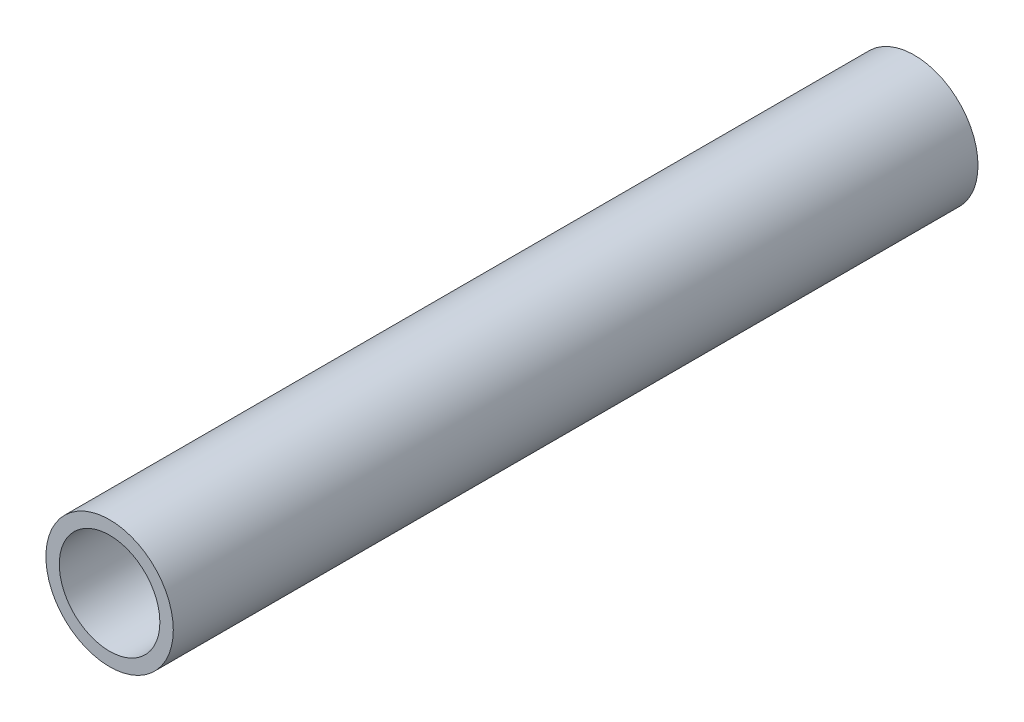
ISO-10303-21;
HEADER;
FILE_DESCRIPTION(('STEP AP214'),'2;1');
FILE_NAME('part.step','',(''),(''),'','','');
FILE_SCHEMA(('AUTOMOTIVE_DESIGN { 1 0 10303 214 1 1 1 1 }'));
ENDSEC;
DATA;
#1=APPLICATION_CONTEXT('core data for automotive mechanical design processes');
#2=APPLICATION_PROTOCOL_DEFINITION('international standard','automotive_design',2000,#1);
#3=PRODUCT_CONTEXT('',#1,'mechanical');
#4=PRODUCT('Part','Part','',(#3));
#5=PRODUCT_RELATED_PRODUCT_CATEGORY('part','',(#4));
#6=PRODUCT_DEFINITION_FORMATION('','',#4);
#7=PRODUCT_DEFINITION_CONTEXT('part definition',#1,'design');
#8=PRODUCT_DEFINITION('design','',#6,#7);
#9=PRODUCT_DEFINITION_SHAPE('','',#8);
#10=(LENGTH_UNIT() NAMED_UNIT(*) SI_UNIT(.MILLI.,.METRE.));
#11=(NAMED_UNIT(*) PLANE_ANGLE_UNIT() SI_UNIT($,.RADIAN.));
#12=(NAMED_UNIT(*) SI_UNIT($,.STERADIAN.) SOLID_ANGLE_UNIT());
#13=UNCERTAINTY_MEASURE_WITH_UNIT(LENGTH_MEASURE(1.E-05),#10,'distance_accuracy_value','');
#14=(GEOMETRIC_REPRESENTATION_CONTEXT(3) GLOBAL_UNCERTAINTY_ASSIGNED_CONTEXT((#13)) GLOBAL_UNIT_ASSIGNED_CONTEXT((#10,
#11,#12)) REPRESENTATION_CONTEXT('',''));
#15=CARTESIAN_POINT('',(0.,0.,0.));
#16=DIRECTION('',(0.,0.,1.));
#17=DIRECTION('',(1.,0.,0.));
#18=AXIS2_PLACEMENT_3D('',#15,#16,#17);
#19=CARTESIAN_POINT('',(0.,0.,304.8));
#20=DIRECTION('',(0.,0.,-1.));
#21=DIRECTION('',(-1.,0.,0.));
#22=AXIS2_PLACEMENT_3D('',#19,#20,#21);
#23=CYLINDRICAL_SURFACE('',#22,19.05);
#24=CARTESIAN_POINT('',(0.,0.,304.8));
#25=DIRECTION('',(0.,0.,1.));
#26=DIRECTION('',(1.,0.,0.));
#27=AXIS2_PLACEMENT_3D('',#24,#25,#26);
#28=CIRCLE('',#27,19.05);
#29=CARTESIAN_POINT('',(19.05,0.,304.8));
#30=VERTEX_POINT('',#29);
#31=EDGE_CURVE('E41',#30,#30,#28,.T.);
#32=ORIENTED_EDGE('',*,*,#31,.T.);
#33=EDGE_LOOP('',(#32));
#34=FACE_BOUND('',#33,.T.);
#35=CARTESIAN_POINT('',(0.,0.,0.));
#36=DIRECTION('',(0.,0.,1.));
#37=DIRECTION('',(1.,0.,0.));
#38=AXIS2_PLACEMENT_3D('',#35,#36,#37);
#39=CIRCLE('',#38,19.05);
#40=CARTESIAN_POINT('',(19.05,0.,0.));
#41=VERTEX_POINT('',#40);
#42=EDGE_CURVE('E47',#41,#41,#39,.T.);
#43=ORIENTED_EDGE('',*,*,#42,.F.);
#44=EDGE_LOOP('',(#43));
#45=FACE_BOUND('',#44,.T.);
#46=ADVANCED_FACE('F34',(#34,#45),#23,.F.);
#47=CARTESIAN_POINT('',(0.,0.,304.8));
#48=DIRECTION('',(0.,0.,-1.));
#49=DIRECTION('',(-1.,0.,0.));
#50=AXIS2_PLACEMENT_3D('',#47,#48,#49);
#51=CYLINDRICAL_SURFACE('',#50,24.13);
#52=CARTESIAN_POINT('',(0.,0.,304.8));
#53=DIRECTION('',(0.,0.,1.));
#54=DIRECTION('',(1.,0.,0.));
#55=AXIS2_PLACEMENT_3D('',#52,#53,#54);
#56=CIRCLE('',#55,24.13);
#57=CARTESIAN_POINT('',(24.13,0.,304.8));
#58=VERTEX_POINT('',#57);
#59=EDGE_CURVE('E10',#58,#58,#56,.T.);
#60=ORIENTED_EDGE('',*,*,#59,.F.);
#61=EDGE_LOOP('',(#60));
#62=FACE_BOUND('',#61,.T.);
#63=CARTESIAN_POINT('',(0.,0.,0.));
#64=DIRECTION('',(0.,0.,1.));
#65=DIRECTION('',(1.,0.,0.));
#66=AXIS2_PLACEMENT_3D('',#63,#64,#65);
#67=CIRCLE('',#66,24.13);
#68=CARTESIAN_POINT('',(24.13,0.,0.));
#69=VERTEX_POINT('',#68);
#70=EDGE_CURVE('E37',#69,#69,#67,.T.);
#71=ORIENTED_EDGE('',*,*,#70,.T.);
#72=EDGE_LOOP('',(#71));
#73=FACE_BOUND('',#72,.T.);
#74=ADVANCED_FACE('F54',(#62,#73),#51,.T.);
#75=CARTESIAN_POINT('',(0.,0.,304.8));
#76=DIRECTION('',(0.,0.,1.));
#77=DIRECTION('',(1.,0.,0.));
#78=AXIS2_PLACEMENT_3D('',#75,#76,#77);
#79=PLANE('',#78);
#80=ORIENTED_EDGE('',*,*,#31,.F.);
#81=EDGE_LOOP('',(#80));
#82=FACE_BOUND('',#81,.T.);
#83=ORIENTED_EDGE('',*,*,#59,.T.);
#84=EDGE_LOOP('',(#83));
#85=FACE_BOUND('',#84,.T.);
#86=ADVANCED_FACE('F58',(#82,#85),#79,.T.);
#87=CARTESIAN_POINT('',(0.,0.,0.));
#88=DIRECTION('',(0.,0.,1.));
#89=DIRECTION('',(1.,0.,0.));
#90=AXIS2_PLACEMENT_3D('',#87,#88,#89);
#91=PLANE('',#90);
#92=ORIENTED_EDGE('',*,*,#42,.T.);
#93=EDGE_LOOP('',(#92));
#94=FACE_BOUND('',#93,.T.);
#95=ORIENTED_EDGE('',*,*,#70,.F.);
#96=EDGE_LOOP('',(#95));
#97=FACE_BOUND('',#96,.T.);
#98=ADVANCED_FACE('F56',(#94,#97),#91,.F.);
#99=CLOSED_SHELL('',(#46,#74,#86,#98));
#100=MANIFOLD_SOLID_BREP('B2',#99);
#101=ADVANCED_BREP_SHAPE_REPRESENTATION('',(#18,#100),#14);
#102=SHAPE_DEFINITION_REPRESENTATION(#9,#101);
ENDSEC;
END-ISO-10303-21;
